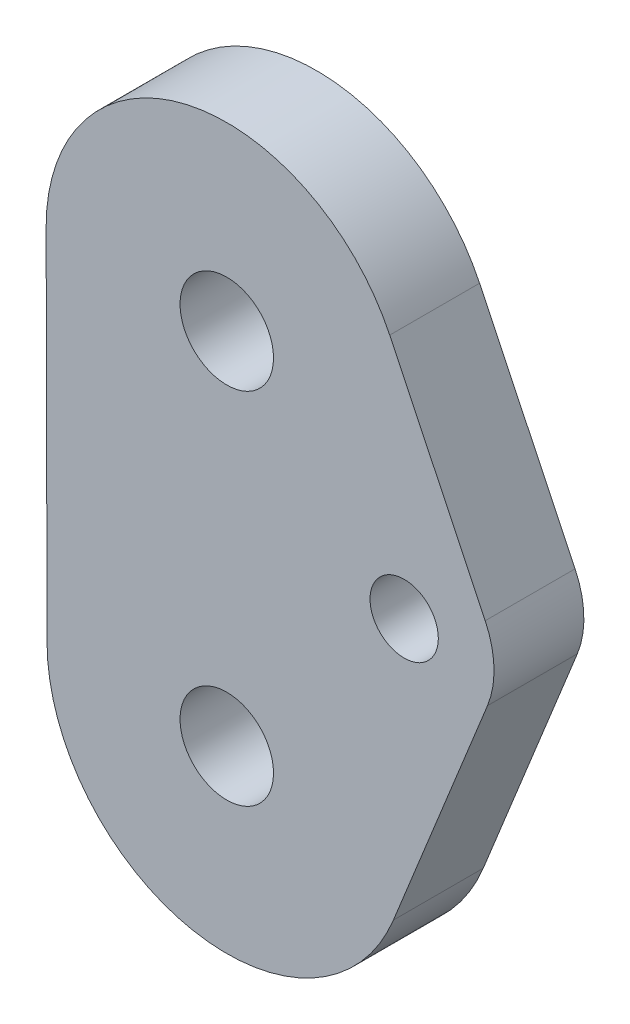
ISO-10303-21;
HEADER;
FILE_DESCRIPTION(('STEP AP214'),'2;1');
FILE_NAME('part.step','',(''),(''),'','','');
FILE_SCHEMA(('AUTOMOTIVE_DESIGN { 1 0 10303 214 1 1 1 1 }'));
ENDSEC;
DATA;
#1=APPLICATION_CONTEXT('core data for automotive mechanical design processes');
#2=APPLICATION_PROTOCOL_DEFINITION('international standard','automotive_design',2000,#1);
#3=PRODUCT_CONTEXT('',#1,'mechanical');
#4=PRODUCT('Part','Part','',(#3));
#5=PRODUCT_RELATED_PRODUCT_CATEGORY('part','',(#4));
#6=PRODUCT_DEFINITION_FORMATION('','',#4);
#7=PRODUCT_DEFINITION_CONTEXT('part definition',#1,'design');
#8=PRODUCT_DEFINITION('design','',#6,#7);
#9=PRODUCT_DEFINITION_SHAPE('','',#8);
#10=(LENGTH_UNIT() NAMED_UNIT(*) SI_UNIT(.MILLI.,.METRE.));
#11=(NAMED_UNIT(*) PLANE_ANGLE_UNIT() SI_UNIT($,.RADIAN.));
#12=(NAMED_UNIT(*) SI_UNIT($,.STERADIAN.) SOLID_ANGLE_UNIT());
#13=UNCERTAINTY_MEASURE_WITH_UNIT(LENGTH_MEASURE(1.E-05),#10,'distance_accuracy_value','');
#14=(GEOMETRIC_REPRESENTATION_CONTEXT(3) GLOBAL_UNCERTAINTY_ASSIGNED_CONTEXT((#13)) GLOBAL_UNIT_ASSIGNED_CONTEXT((#10,
#11,#12)) REPRESENTATION_CONTEXT('',''));
#15=CARTESIAN_POINT('',(0.,0.,0.));
#16=DIRECTION('',(0.,0.,1.));
#17=DIRECTION('',(1.,0.,0.));
#18=AXIS2_PLACEMENT_3D('',#15,#16,#17);
#19=CARTESIAN_POINT('',(56.9858620115287,-53.4430988360536,6.35));
#20=DIRECTION('',(0.,0.,1.));
#21=DIRECTION('',(1.,0.,0.));
#22=AXIS2_PLACEMENT_3D('',#19,#20,#21);
#23=PLANE('',#22);
#24=CARTESIAN_POINT('',(44.45,-67.508733918,6.35));
#25=DIRECTION('',(0.,0.,1.));
#26=DIRECTION('',(1.,0.,0.));
#27=AXIS2_PLACEMENT_3D('',#24,#25,#26);
#28=CIRCLE('',#27,3.30199999999999);
#29=CARTESIAN_POINT('',(47.752,-67.508733918,6.35));
#30=VERTEX_POINT('',#29);
#31=EDGE_CURVE('E185',#30,#30,#28,.T.);
#32=ORIENTED_EDGE('',*,*,#31,.F.);
#33=EDGE_LOOP('',(#32));
#34=FACE_BOUND('',#33,.T.);
#35=CARTESIAN_POINT('',(56.9858620115287,-53.4430988360536,6.35));
#36=DIRECTION('',(0.,0.,1.));
#37=DIRECTION('',(1.,0.,0.));
#38=AXIS2_PLACEMENT_3D('',#35,#36,#37);
#39=CIRCLE('',#38,6.35000000000002);
#40=CARTESIAN_POINT('',(62.8729470539659,-55.8231681004053,6.35));
#41=VERTEX_POINT('',#40);
#42=CARTESIAN_POINT('',(62.7137700058897,-50.7020096349996,6.35));
#43=VERTEX_POINT('',#42);
#44=EDGE_CURVE('E130',#41,#43,#39,.T.);
#45=ORIENTED_EDGE('',*,*,#44,.T.);
#46=DIRECTION('',(-0.431667590717168,0.902032755017486,0.));
#47=VECTOR('',#46,1.);
#48=CARTESIAN_POINT('',(55.9645204159877,-36.5984625242115,6.35));
#49=LINE('',#48,#47);
#50=CARTESIAN_POINT('',(55.9645204159877,-36.5984625242115,6.35));
#51=VERTEX_POINT('',#50);
#52=EDGE_CURVE('E88',#43,#51,#49,.T.);
#53=ORIENTED_EDGE('',*,*,#52,.T.);
#54=CARTESIAN_POINT('',(44.45,-42.108733918,6.35));
#55=DIRECTION('',(0.,0.,1.));
#56=DIRECTION('',(1.,0.,0.));
#57=AXIS2_PLACEMENT_3D('',#54,#55,#56);
#58=CIRCLE('',#57,12.7650801502929);
#59=CARTESIAN_POINT('',(31.6849617506624,-42.1414407422001,6.35));
#60=VERTEX_POINT('',#59);
#61=EDGE_CURVE('E101',#51,#60,#58,.T.);
#62=ORIENTED_EDGE('',*,*,#61,.T.);
#63=DIRECTION('',(0.00256221064145207,-0.999996717532927,0.));
#64=VECTOR('',#63,1.);
#65=CARTESIAN_POINT('',(31.7500416873318,-67.5412739931465,6.35));
#66=LINE('',#65,#64);
#67=CARTESIAN_POINT('',(31.7500416873318,-67.5412739931465,6.35));
#68=VERTEX_POINT('',#67);
#69=EDGE_CURVE('E95',#60,#68,#66,.T.);
#70=ORIENTED_EDGE('',*,*,#69,.T.);
#71=CARTESIAN_POINT('',(44.45,-67.508733918,6.35));
#72=DIRECTION('',(0.,0.,1.));
#73=DIRECTION('',(1.,0.,0.));
#74=AXIS2_PLACEMENT_3D('',#71,#72,#73);
#75=CIRCLE('',#74,12.7);
#76=CARTESIAN_POINT('',(56.2241700848745,-72.2688724467034,6.35));
#77=VERTEX_POINT('',#76);
#78=EDGE_CURVE('E99',#68,#77,#75,.T.);
#79=ORIENTED_EDGE('',*,*,#78,.T.);
#80=DIRECTION('',(0.374814057378221,0.927100006683031,0.));
#81=VECTOR('',#80,1.);
#82=CARTESIAN_POINT('',(62.8729470539659,-55.8231681004053,6.35));
#83=LINE('',#82,#81);
#84=EDGE_CURVE('E51',#77,#41,#83,.T.);
#85=ORIENTED_EDGE('',*,*,#84,.T.);
#86=EDGE_LOOP('',(#45,#53,#62,#70,#79,#85));
#87=FACE_BOUND('',#86,.T.);
#88=CARTESIAN_POINT('',(56.9858620115287,-53.4430988360536,6.35));
#89=DIRECTION('',(0.,0.,1.));
#90=DIRECTION('',(1.,0.,0.));
#91=AXIS2_PLACEMENT_3D('',#88,#89,#90);
#92=CIRCLE('',#91,2.41299999999999);
#93=CARTESIAN_POINT('',(59.3988620115286,-53.4430988360536,6.35));
#94=VERTEX_POINT('',#93);
#95=EDGE_CURVE('E123',#94,#94,#92,.T.);
#96=ORIENTED_EDGE('',*,*,#95,.F.);
#97=EDGE_LOOP('',(#96));
#98=FACE_BOUND('',#97,.T.);
#99=CARTESIAN_POINT('',(44.45,-42.108733918,6.35));
#100=DIRECTION('',(0.,0.,1.));
#101=DIRECTION('',(1.,0.,0.));
#102=AXIS2_PLACEMENT_3D('',#99,#100,#101);
#103=CIRCLE('',#102,3.30199999999999);
#104=CARTESIAN_POINT('',(47.752,-42.108733918,6.35));
#105=VERTEX_POINT('',#104);
#106=EDGE_CURVE('E176',#105,#105,#103,.T.);
#107=ORIENTED_EDGE('',*,*,#106,.F.);
#108=EDGE_LOOP('',(#107));
#109=FACE_BOUND('',#108,.T.);
#110=ADVANCED_FACE('F34',(#34,#87,#98,#109),#23,.T.);
#111=CARTESIAN_POINT('',(56.9858620115287,-53.4430988360536,0.));
#112=DIRECTION('',(0.,0.,1.));
#113=DIRECTION('',(1.,0.,0.));
#114=AXIS2_PLACEMENT_3D('',#111,#112,#113);
#115=PLANE('',#114);
#116=CARTESIAN_POINT('',(56.9858620115287,-53.4430988360536,0.));
#117=DIRECTION('',(0.,0.,1.));
#118=DIRECTION('',(1.,0.,0.));
#119=AXIS2_PLACEMENT_3D('',#116,#117,#118);
#120=CIRCLE('',#119,6.35000000000002);
#121=CARTESIAN_POINT('',(62.8729470539659,-55.8231681004053,0.));
#122=VERTEX_POINT('',#121);
#123=CARTESIAN_POINT('',(62.7137700058897,-50.7020096349996,0.));
#124=VERTEX_POINT('',#123);
#125=EDGE_CURVE('E119',#122,#124,#120,.T.);
#126=ORIENTED_EDGE('',*,*,#125,.F.);
#127=DIRECTION('',(0.374814057378221,0.927100006683031,0.));
#128=VECTOR('',#127,1.);
#129=CARTESIAN_POINT('',(62.8729470539659,-55.8231681004053,0.));
#130=LINE('',#129,#128);
#131=CARTESIAN_POINT('',(56.2241700848745,-72.2688724467034,0.));
#132=VERTEX_POINT('',#131);
#133=EDGE_CURVE('E80',#132,#122,#130,.T.);
#134=ORIENTED_EDGE('',*,*,#133,.F.);
#135=CARTESIAN_POINT('',(44.45,-67.508733918,0.));
#136=DIRECTION('',(0.,0.,1.));
#137=DIRECTION('',(1.,0.,0.));
#138=AXIS2_PLACEMENT_3D('',#135,#136,#137);
#139=CIRCLE('',#138,12.7);
#140=CARTESIAN_POINT('',(31.7500416873318,-67.5412739931465,0.));
#141=VERTEX_POINT('',#140);
#142=EDGE_CURVE('E74',#141,#132,#139,.T.);
#143=ORIENTED_EDGE('',*,*,#142,.F.);
#144=DIRECTION('',(0.00256221064145207,-0.999996717532927,0.));
#145=VECTOR('',#144,1.);
#146=CARTESIAN_POINT('',(31.7500416873318,-67.5412739931465,0.));
#147=LINE('',#146,#145);
#148=CARTESIAN_POINT('',(31.6849617506624,-42.1414407422001,0.));
#149=VERTEX_POINT('',#148);
#150=EDGE_CURVE('E109',#149,#141,#147,.T.);
#151=ORIENTED_EDGE('',*,*,#150,.F.);
#152=CARTESIAN_POINT('',(44.45,-42.108733918,0.));
#153=DIRECTION('',(0.,0.,1.));
#154=DIRECTION('',(1.,0.,0.));
#155=AXIS2_PLACEMENT_3D('',#152,#153,#154);
#156=CIRCLE('',#155,12.7650801502929);
#157=CARTESIAN_POINT('',(55.9645204159877,-36.5984625242115,0.));
#158=VERTEX_POINT('',#157);
#159=EDGE_CURVE('E125',#158,#149,#156,.T.);
#160=ORIENTED_EDGE('',*,*,#159,.F.);
#161=DIRECTION('',(-0.431667590717168,0.902032755017486,0.));
#162=VECTOR('',#161,1.);
#163=CARTESIAN_POINT('',(55.9645204159877,-36.5984625242115,0.));
#164=LINE('',#163,#162);
#165=EDGE_CURVE('E122',#124,#158,#164,.T.);
#166=ORIENTED_EDGE('',*,*,#165,.F.);
#167=EDGE_LOOP('',(#126,#134,#143,#151,#160,#166));
#168=FACE_BOUND('',#167,.T.);
#169=CARTESIAN_POINT('',(56.9858620115287,-53.4430988360536,0.));
#170=DIRECTION('',(0.,0.,1.));
#171=DIRECTION('',(1.,0.,0.));
#172=AXIS2_PLACEMENT_3D('',#169,#170,#171);
#173=CIRCLE('',#172,2.41299999999999);
#174=CARTESIAN_POINT('',(59.3988620115286,-53.4430988360536,0.));
#175=VERTEX_POINT('',#174);
#176=EDGE_CURVE('E188',#175,#175,#173,.T.);
#177=ORIENTED_EDGE('',*,*,#176,.T.);
#178=EDGE_LOOP('',(#177));
#179=FACE_BOUND('',#178,.T.);
#180=CARTESIAN_POINT('',(44.45,-67.508733918,0.));
#181=DIRECTION('',(0.,0.,1.));
#182=DIRECTION('',(1.,0.,0.));
#183=AXIS2_PLACEMENT_3D('',#180,#181,#182);
#184=CIRCLE('',#183,3.30199999999999);
#185=CARTESIAN_POINT('',(47.752,-67.508733918,0.));
#186=VERTEX_POINT('',#185);
#187=EDGE_CURVE('E182',#186,#186,#184,.T.);
#188=ORIENTED_EDGE('',*,*,#187,.T.);
#189=EDGE_LOOP('',(#188));
#190=FACE_BOUND('',#189,.T.);
#191=CARTESIAN_POINT('',(44.45,-42.108733918,0.));
#192=DIRECTION('',(0.,0.,1.));
#193=DIRECTION('',(1.,0.,0.));
#194=AXIS2_PLACEMENT_3D('',#191,#192,#193);
#195=CIRCLE('',#194,3.30199999999999);
#196=CARTESIAN_POINT('',(47.752,-42.108733918,0.));
#197=VERTEX_POINT('',#196);
#198=EDGE_CURVE('E179',#197,#197,#195,.T.);
#199=ORIENTED_EDGE('',*,*,#198,.T.);
#200=EDGE_LOOP('',(#199));
#201=FACE_BOUND('',#200,.T.);
#202=ADVANCED_FACE('F139',(#168,#179,#190,#201),#115,.F.);
#203=CARTESIAN_POINT('',(56.9858620115287,-53.4430988360536,6.35));
#204=DIRECTION('',(0.,0.,-1.));
#205=DIRECTION('',(-1.,0.,0.));
#206=AXIS2_PLACEMENT_3D('',#203,#204,#205);
#207=CYLINDRICAL_SURFACE('',#206,6.35000000000002);
#208=ORIENTED_EDGE('',*,*,#125,.T.);
#209=DIRECTION('',(0.,0.,-1.));
#210=VECTOR('',#209,1.);
#211=CARTESIAN_POINT('',(62.7137700058897,-50.7020096349996,6.35));
#212=LINE('',#211,#210);
#213=EDGE_CURVE('E11',#43,#124,#212,.T.);
#214=ORIENTED_EDGE('',*,*,#213,.F.);
#215=ORIENTED_EDGE('',*,*,#44,.F.);
#216=DIRECTION('',(0.,0.,-1.));
#217=VECTOR('',#216,1.);
#218=CARTESIAN_POINT('',(62.8729470539659,-55.8231681004053,6.35));
#219=LINE('',#218,#217);
#220=EDGE_CURVE('E115',#41,#122,#219,.T.);
#221=ORIENTED_EDGE('',*,*,#220,.T.);
#222=EDGE_LOOP('',(#208,#214,#215,#221));
#223=FACE_BOUND('',#222,.T.);
#224=ADVANCED_FACE('F36',(#223),#207,.T.);
#225=CARTESIAN_POINT('',(55.9645204159877,-36.5984625242115,6.35));
#226=DIRECTION('',(-0.902032755017486,-0.431667590717168,0.));
#227=DIRECTION('',(0.431667590717168,-0.902032755017486,0.));
#228=AXIS2_PLACEMENT_3D('',#225,#226,#227);
#229=PLANE('',#228);
#230=ORIENTED_EDGE('',*,*,#165,.T.);
#231=DIRECTION('',(0.,0.,-1.));
#232=VECTOR('',#231,1.);
#233=CARTESIAN_POINT('',(55.9645204159877,-36.5984625242115,6.35));
#234=LINE('',#233,#232);
#235=EDGE_CURVE('E43',#51,#158,#234,.T.);
#236=ORIENTED_EDGE('',*,*,#235,.F.);
#237=ORIENTED_EDGE('',*,*,#52,.F.);
#238=ORIENTED_EDGE('',*,*,#213,.T.);
#239=EDGE_LOOP('',(#230,#236,#237,#238));
#240=FACE_BOUND('',#239,.T.);
#241=ADVANCED_FACE('F238',(#240),#229,.F.);
#242=CARTESIAN_POINT('',(44.45,-42.108733918,6.35));
#243=DIRECTION('',(0.,0.,-1.));
#244=DIRECTION('',(-1.,0.,0.));
#245=AXIS2_PLACEMENT_3D('',#242,#243,#244);
#246=CYLINDRICAL_SURFACE('',#245,12.7650801502929);
#247=ORIENTED_EDGE('',*,*,#159,.T.);
#248=DIRECTION('',(0.,0.,-1.));
#249=VECTOR('',#248,1.);
#250=CARTESIAN_POINT('',(31.6849617506624,-42.1414407422001,6.35));
#251=LINE('',#250,#249);
#252=EDGE_CURVE('E110',#60,#149,#251,.T.);
#253=ORIENTED_EDGE('',*,*,#252,.F.);
#254=ORIENTED_EDGE('',*,*,#61,.F.);
#255=ORIENTED_EDGE('',*,*,#235,.T.);
#256=EDGE_LOOP('',(#247,#253,#254,#255));
#257=FACE_BOUND('',#256,.T.);
#258=ADVANCED_FACE('F136',(#257),#246,.T.);
#259=CARTESIAN_POINT('',(31.7500416873318,-67.5412739931465,6.35));
#260=DIRECTION('',(0.999996717532927,0.00256221064145207,0.));
#261=DIRECTION('',(-0.00256221064145207,0.999996717532927,0.));
#262=AXIS2_PLACEMENT_3D('',#259,#260,#261);
#263=PLANE('',#262);
#264=ORIENTED_EDGE('',*,*,#150,.T.);
#265=DIRECTION('',(0.,0.,-1.));
#266=VECTOR('',#265,1.);
#267=CARTESIAN_POINT('',(31.7500416873318,-67.5412739931465,6.35));
#268=LINE('',#267,#266);
#269=EDGE_CURVE('E106',#68,#141,#268,.T.);
#270=ORIENTED_EDGE('',*,*,#269,.F.);
#271=ORIENTED_EDGE('',*,*,#69,.F.);
#272=ORIENTED_EDGE('',*,*,#252,.T.);
#273=EDGE_LOOP('',(#264,#270,#271,#272));
#274=FACE_BOUND('',#273,.T.);
#275=ADVANCED_FACE('F107',(#274),#263,.F.);
#276=CARTESIAN_POINT('',(44.45,-67.508733918,6.35));
#277=DIRECTION('',(0.,0.,-1.));
#278=DIRECTION('',(-1.,0.,0.));
#279=AXIS2_PLACEMENT_3D('',#276,#277,#278);
#280=CYLINDRICAL_SURFACE('',#279,12.7);
#281=ORIENTED_EDGE('',*,*,#142,.T.);
#282=DIRECTION('',(0.,0.,-1.));
#283=VECTOR('',#282,1.);
#284=CARTESIAN_POINT('',(56.2241700848745,-72.2688724467034,6.35));
#285=LINE('',#284,#283);
#286=EDGE_CURVE('E111',#77,#132,#285,.T.);
#287=ORIENTED_EDGE('',*,*,#286,.F.);
#288=ORIENTED_EDGE('',*,*,#78,.F.);
#289=ORIENTED_EDGE('',*,*,#269,.T.);
#290=EDGE_LOOP('',(#281,#287,#288,#289));
#291=FACE_BOUND('',#290,.T.);
#292=ADVANCED_FACE('F113',(#291),#280,.T.);
#293=CARTESIAN_POINT('',(62.8729470539659,-55.8231681004053,6.35));
#294=DIRECTION('',(-0.927100006683031,0.374814057378221,0.));
#295=DIRECTION('',(-0.374814057378221,-0.927100006683031,0.));
#296=AXIS2_PLACEMENT_3D('',#293,#294,#295);
#297=PLANE('',#296);
#298=ORIENTED_EDGE('',*,*,#133,.T.);
#299=ORIENTED_EDGE('',*,*,#220,.F.);
#300=ORIENTED_EDGE('',*,*,#84,.F.);
#301=ORIENTED_EDGE('',*,*,#286,.T.);
#302=EDGE_LOOP('',(#298,#299,#300,#301));
#303=FACE_BOUND('',#302,.T.);
#304=ADVANCED_FACE('F144',(#303),#297,.F.);
#305=CARTESIAN_POINT('',(56.9858620115287,-53.4430988360536,6.35));
#306=DIRECTION('',(0.,0.,-1.));
#307=DIRECTION('',(-1.,0.,0.));
#308=AXIS2_PLACEMENT_3D('',#305,#306,#307);
#309=CYLINDRICAL_SURFACE('',#308,2.41299999999999);
#310=ORIENTED_EDGE('',*,*,#95,.T.);
#311=EDGE_LOOP('',(#310));
#312=FACE_BOUND('',#311,.T.);
#313=ORIENTED_EDGE('',*,*,#176,.F.);
#314=EDGE_LOOP('',(#313));
#315=FACE_BOUND('',#314,.T.);
#316=ADVANCED_FACE('F146',(#312,#315),#309,.F.);
#317=CARTESIAN_POINT('',(44.45,-67.508733918,6.35));
#318=DIRECTION('',(0.,0.,-1.));
#319=DIRECTION('',(-1.,0.,0.));
#320=AXIS2_PLACEMENT_3D('',#317,#318,#319);
#321=CYLINDRICAL_SURFACE('',#320,3.30199999999999);
#322=ORIENTED_EDGE('',*,*,#31,.T.);
#323=EDGE_LOOP('',(#322));
#324=FACE_BOUND('',#323,.T.);
#325=ORIENTED_EDGE('',*,*,#187,.F.);
#326=EDGE_LOOP('',(#325));
#327=FACE_BOUND('',#326,.T.);
#328=ADVANCED_FACE('F152',(#324,#327),#321,.F.);
#329=CARTESIAN_POINT('',(44.45,-42.108733918,6.35));
#330=DIRECTION('',(0.,0.,-1.));
#331=DIRECTION('',(-1.,0.,0.));
#332=AXIS2_PLACEMENT_3D('',#329,#330,#331);
#333=CYLINDRICAL_SURFACE('',#332,3.30199999999999);
#334=ORIENTED_EDGE('',*,*,#106,.T.);
#335=EDGE_LOOP('',(#334));
#336=FACE_BOUND('',#335,.T.);
#337=ORIENTED_EDGE('',*,*,#198,.F.);
#338=EDGE_LOOP('',(#337));
#339=FACE_BOUND('',#338,.T.);
#340=ADVANCED_FACE('F167',(#336,#339),#333,.F.);
#341=CLOSED_SHELL('',(#110,#202,#224,#241,#258,#275,#292,#304,#316,#328,#340));
#342=MANIFOLD_SOLID_BREP('B2',#341);
#343=ADVANCED_BREP_SHAPE_REPRESENTATION('',(#18,#342),#14);
#344=SHAPE_DEFINITION_REPRESENTATION(#9,#343);
ENDSEC;
END-ISO-10303-21;
